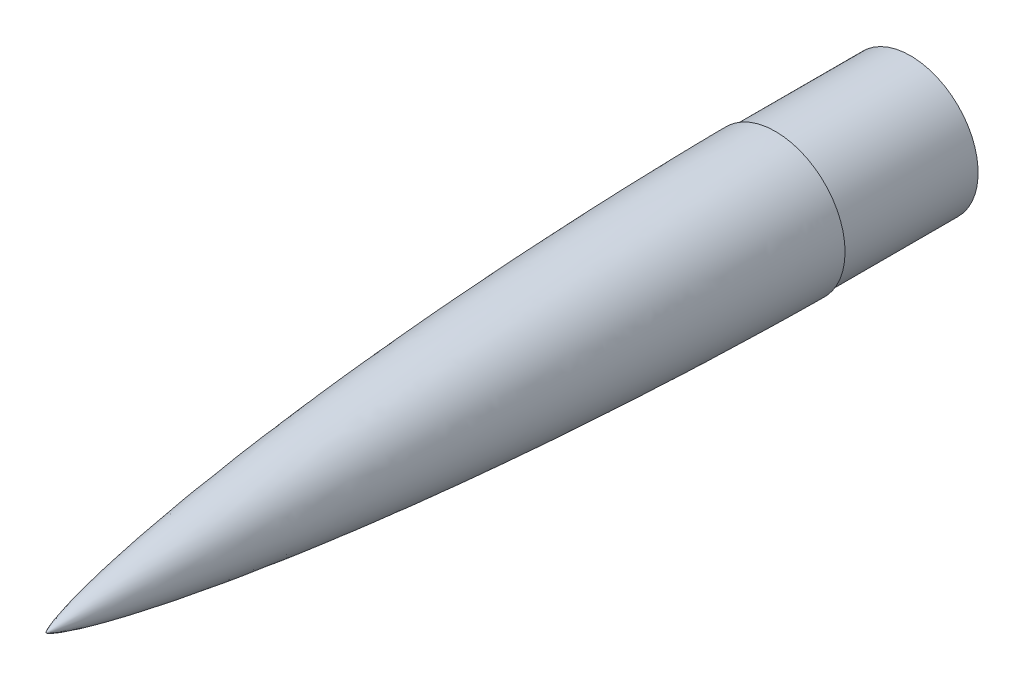
ISO-10303-21;
HEADER;
FILE_DESCRIPTION(('STEP AP214'),'2;1');
FILE_NAME('part.step','',(''),(''),'','','');
FILE_SCHEMA(('AUTOMOTIVE_DESIGN { 1 0 10303 214 1 1 1 1 }'));
ENDSEC;
DATA;
#1=APPLICATION_CONTEXT('core data for automotive mechanical design processes');
#2=APPLICATION_PROTOCOL_DEFINITION('international standard','automotive_design',2000,#1);
#3=PRODUCT_CONTEXT('',#1,'mechanical');
#4=PRODUCT('Part','Part','',(#3));
#5=PRODUCT_RELATED_PRODUCT_CATEGORY('part','',(#4));
#6=PRODUCT_DEFINITION_FORMATION('','',#4);
#7=PRODUCT_DEFINITION_CONTEXT('part definition',#1,'design');
#8=PRODUCT_DEFINITION('design','',#6,#7);
#9=PRODUCT_DEFINITION_SHAPE('','',#8);
#10=(LENGTH_UNIT() NAMED_UNIT(*) SI_UNIT(.MILLI.,.METRE.));
#11=(NAMED_UNIT(*) PLANE_ANGLE_UNIT() SI_UNIT($,.RADIAN.));
#12=(NAMED_UNIT(*) SI_UNIT($,.STERADIAN.) SOLID_ANGLE_UNIT());
#13=UNCERTAINTY_MEASURE_WITH_UNIT(LENGTH_MEASURE(1.E-05),#10,'distance_accuracy_value','');
#14=(GEOMETRIC_REPRESENTATION_CONTEXT(3) GLOBAL_UNCERTAINTY_ASSIGNED_CONTEXT((#13)) GLOBAL_UNIT_ASSIGNED_CONTEXT((#10,
#11,#12)) REPRESENTATION_CONTEXT('',''));
#15=CARTESIAN_POINT('',(0.,0.,0.));
#16=DIRECTION('',(0.,0.,1.));
#17=DIRECTION('',(1.,0.,0.));
#18=AXIS2_PLACEMENT_3D('',#15,#16,#17);
#19=CARTESIAN_POINT('',(0.,65.405,-685.8));
#20=CARTESIAN_POINT('',(0.,65.405,-684.485121272052));
#21=CARTESIAN_POINT('',(0.,65.3935205793124,-681.855376015666));
#22=CARTESIAN_POINT('',(0.,65.3735303170833,-677.910796563461));
#23=CARTESIAN_POINT('',(0.,65.3316998729456,-672.651436745629));
#24=CARTESIAN_POINT('',(0.,65.2692221043456,-666.077341219304));
#25=CARTESIAN_POINT('',(0.,65.1767470561121,-658.188600750671));
#26=CARTESIAN_POINT('',(0.,65.0474827604112,-648.94209479533));
#27=CARTESIAN_POINT('',(0.,64.7840244466443,-632.992707932571));
#28=CARTESIAN_POINT('',(0.,64.402473986804,-614.328747749962));
#29=CARTESIAN_POINT('',(0.,63.8726305660593,-592.951178627487));
#30=CARTESIAN_POINT('',(0.,63.0009991094314,-563.561033109567));
#31=CARTESIAN_POINT('',(0.,62.0623088945785,-536.847380859153));
#32=CARTESIAN_POINT('',(0.,60.9782163749543,-510.139226829273));
#33=CARTESIAN_POINT('',(0.,59.5005574289602,-478.097232785945));
#34=CARTESIAN_POINT('',(0.,57.8440341458656,-446.063808120787));
#35=CARTESIAN_POINT('',(0.,55.6441802473817,-408.706059524546));
#36=CARTESIAN_POINT('',(0.,52.7471290580236,-366.035691483811));
#37=CARTESIAN_POINT('',(0.,49.4446728295142,-323.394730687329));
#38=CARTESIAN_POINT('',(0.,45.7076004696462,-280.789499898449));
#39=CARTESIAN_POINT('',(0.,41.4956600630884,-238.228469901065));
#40=CARTESIAN_POINT('',(0.,36.754430002566,-195.722819830797));
#41=CARTESIAN_POINT('',(0.,31.4017407102855,-153.289449921695));
#42=CARTESIAN_POINT('',(0.,25.4687603314321,-112.040265782445));
#43=CARTESIAN_POINT('',(0.,19.5038981612316,-76.2047078542628));
#44=CARTESIAN_POINT('',(0.,13.9525085959273,-47.6298391838727));
#45=CARTESIAN_POINT('',(0.,9.38962699765855,-27.7350056304969));
#46=CARTESIAN_POINT('',(0.,6.31662131154601,-16.2109428625035));
#47=CARTESIAN_POINT('',(0.,4.18194651098269,-9.31832052248213));
#48=CARTESIAN_POINT('',(0.,2.79784507385194,-5.4483382524516));
#49=CARTESIAN_POINT('',(0.,1.91750850209447,-3.29300440985363));
#50=CARTESIAN_POINT('',(0.,1.37696095382615,-2.12335210684411));
#51=CARTESIAN_POINT('',(0.,1.04703872782662,-1.4784356818174));
#52=CARTESIAN_POINT('',(0.,0.822025620675648,-1.07155708893394));
#53=CARTESIAN_POINT('',(0.,0.67770029633276,-0.827068410392984));
#54=CARTESIAN_POINT('',(0.,0.546173066213784,-0.619898716914429));
#55=CARTESIAN_POINT('',(0.,0.428627231545043,-0.44979484773894));
#56=CARTESIAN_POINT('',(0.,0.349869153991174,-0.342466914738959));
#57=CARTESIAN_POINT('',(0.,0.276487255814619,-0.249756901936484));
#58=CARTESIAN_POINT('',(0.,0.208876089667496,-0.171483687558604));
#59=CARTESIAN_POINT('',(0.,0.147595052902646,-0.107673788922353));
#60=CARTESIAN_POINT('',(0.,0.10038741614022,-0.0636410587873789));
#61=CARTESIAN_POINT('',(0.,0.057075747949246,-0.0295232944577308));
#62=CARTESIAN_POINT('',(0.,0.0259041000770289,-0.00934966268541325));
#63=CARTESIAN_POINT('',(0.,0.00888026648789547,-0.00253064911690683));
#64=CARTESIAN_POINT('',(0.,0.,0.));
#65=B_SPLINE_CURVE_WITH_KNOTS('',4,(#19,#20,#21,#22,#23,#24,#25,#26,#27,#28,#29,#30,#31,#32,#33,
#34,#35,#36,#37,#38,#39,#40,#41,#42,#43,#44,#45,#46,#47,#48,#49,#50,#51,#52,#53,#54,#55,#56,#57,
#58,#59,#60,#61,#62,#63,#64),.UNSPECIFIED.,.F.,.F.,(5,1,1,1,1,1,1,1,1,1,1,1,1,1,1,1,1,1,1,1,1,1,
1,1,1,1,1,1,1,1,1,1,1,1,1,1,1,1,1,1,1,1,5),(0.,0.0076133259681177,0.0152266519362353,
0.0228399779043529,0.0304533038724706,0.0456799558087058,0.0609066077449411,0.076383683622995,
0.122814911257156,0.153768987695562,0.184723064133968,0.246630947086405,0.277585037404755,
0.308539127723105,0.370447211764446,0.432355342958083,0.494263450690412,0.556171550507095,
0.618079641608188,0.679987764671959,0.741895958561139,0.803803741959616,0.865712233170095,
0.921268011395524,0.952222444156783,0.972320807088128,0.983875785687456,0.990309813622096,
0.993990407520034,0.996111260196595,0.997352115754301,0.997768050198311,0.99818398464232,
0.998803112901376,0.998995768891883,0.999188424882391,0.999381080872898,0.999573736863405,
0.999680302647554,0.999786868431703,0.999893434215851,0.999946717107926,1.),.UNSPECIFIED.);
#66=CARTESIAN_POINT('',(0.,0.,0.));
#67=DIRECTION('',(0.,0.,1.));
#68=AXIS1_PLACEMENT('',#66,#67);
#69=SURFACE_OF_REVOLUTION('',#65,#68);
#70=CARTESIAN_POINT('',(0.,0.,0.));
#71=VERTEX_POINT('',#70);
#72=VERTEX_LOOP('',#71);
#73=FACE_BOUND('',#72,.T.);
#74=CARTESIAN_POINT('',(0.,0.,-685.8));
#75=DIRECTION('',(0.,0.,1.));
#76=DIRECTION('',(1.,0.,0.));
#77=AXIS2_PLACEMENT_3D('',#74,#75,#76);
#78=CIRCLE('',#77,65.405);
#79=CARTESIAN_POINT('',(65.405,0.,-685.8));
#80=VERTEX_POINT('',#79);
#81=EDGE_CURVE('E51',#80,#80,#78,.T.);
#82=ORIENTED_EDGE('',*,*,#81,.T.);
#83=EDGE_LOOP('',(#82));
#84=FACE_BOUND('',#83,.T.);
#85=ADVANCED_FACE('F43',(#73,#84),#69,.T.);
#86=CARTESIAN_POINT('',(0.,0.,-685.8));
#87=DIRECTION('',(0.,0.,1.));
#88=DIRECTION('',(1.,0.,0.));
#89=AXIS2_PLACEMENT_3D('',#86,#87,#88);
#90=PLANE('',#89);
#91=CARTESIAN_POINT('',(0.,0.,-685.8));
#92=DIRECTION('',(0.,0.,-1.));
#93=DIRECTION('',(-1.,0.,0.));
#94=AXIS2_PLACEMENT_3D('',#91,#92,#93);
#95=CIRCLE('',#94,63.5);
#96=CARTESIAN_POINT('',(-63.5,0.,-685.8));
#97=VERTEX_POINT('',#96);
#98=EDGE_CURVE('E84',#97,#97,#95,.T.);
#99=ORIENTED_EDGE('',*,*,#98,.F.);
#100=EDGE_LOOP('',(#99));
#101=FACE_BOUND('',#100,.T.);
#102=ORIENTED_EDGE('',*,*,#81,.F.);
#103=EDGE_LOOP('',(#102));
#104=FACE_BOUND('',#103,.T.);
#105=ADVANCED_FACE('F72',(#101,#104),#90,.F.);
#106=CARTESIAN_POINT('',(0.,0.,-812.8));
#107=DIRECTION('',(0.,0.,-1.));
#108=DIRECTION('',(-1.,0.,0.));
#109=AXIS2_PLACEMENT_3D('',#106,#107,#108);
#110=PLANE('',#109);
#111=CARTESIAN_POINT('',(0.,0.,-812.8));
#112=DIRECTION('',(0.,0.,-1.));
#113=DIRECTION('',(-1.,0.,0.));
#114=AXIS2_PLACEMENT_3D('',#111,#112,#113);
#115=CIRCLE('',#114,63.5);
#116=CARTESIAN_POINT('',(-63.5,0.,-812.8));
#117=VERTEX_POINT('',#116);
#118=EDGE_CURVE('E82',#117,#117,#115,.T.);
#119=ORIENTED_EDGE('',*,*,#118,.T.);
#120=EDGE_LOOP('',(#119));
#121=FACE_BOUND('',#120,.T.);
#122=CARTESIAN_POINT('',(0.,0.,-812.8));
#123=DIRECTION('',(0.,0.,-1.));
#124=DIRECTION('',(-1.,0.,0.));
#125=AXIS2_PLACEMENT_3D('',#122,#123,#124);
#126=CIRCLE('',#125,61.976);
#127=CARTESIAN_POINT('',(-61.976,0.,-812.8));
#128=VERTEX_POINT('',#127);
#129=EDGE_CURVE('E102',#128,#128,#126,.T.);
#130=ORIENTED_EDGE('',*,*,#129,.F.);
#131=EDGE_LOOP('',(#130));
#132=FACE_BOUND('',#131,.T.);
#133=ADVANCED_FACE('F76',(#121,#132),#110,.T.);
#134=CARTESIAN_POINT('',(0.,0.,-812.8));
#135=DIRECTION('',(0.,0.,1.));
#136=DIRECTION('',(1.,0.,0.));
#137=AXIS2_PLACEMENT_3D('',#134,#135,#136);
#138=CYLINDRICAL_SURFACE('',#137,63.5);
#139=ORIENTED_EDGE('',*,*,#118,.F.);
#140=EDGE_LOOP('',(#139));
#141=FACE_BOUND('',#140,.T.);
#142=ORIENTED_EDGE('',*,*,#98,.T.);
#143=EDGE_LOOP('',(#142));
#144=FACE_BOUND('',#143,.T.);
#145=ADVANCED_FACE('F65',(#141,#144),#138,.T.);
#146=CARTESIAN_POINT('',(0.,0.,-812.8));
#147=DIRECTION('',(0.,0.,1.));
#148=DIRECTION('',(1.,0.,0.));
#149=AXIS2_PLACEMENT_3D('',#146,#147,#148);
#150=CYLINDRICAL_SURFACE('',#149,61.976);
#151=ORIENTED_EDGE('',*,*,#129,.T.);
#152=EDGE_LOOP('',(#151));
#153=FACE_BOUND('',#152,.T.);
#154=CARTESIAN_POINT('',(0.,0.,-594.212276674996));
#155=DIRECTION('',(0.,0.,1.));
#156=DIRECTION('',(1.,0.,0.));
#157=AXIS2_PLACEMENT_3D('',#154,#155,#156);
#158=CIRCLE('',#157,61.976);
#159=CARTESIAN_POINT('',(61.976,0.,-594.212276674996));
#160=VERTEX_POINT('',#159);
#161=EDGE_CURVE('E11',#160,#160,#158,.T.);
#162=ORIENTED_EDGE('',*,*,#161,.T.);
#163=EDGE_LOOP('',(#162));
#164=FACE_BOUND('',#163,.T.);
#165=ADVANCED_FACE('F59',(#153,#164),#150,.F.);
#166=CARTESIAN_POINT('',(0.,65.405,-685.8));
#167=CARTESIAN_POINT('',(0.,65.405,-684.485121272052));
#168=CARTESIAN_POINT('',(0.,65.3935205793124,-681.855376015666));
#169=CARTESIAN_POINT('',(0.,65.3735303170833,-677.910796563461));
#170=CARTESIAN_POINT('',(0.,65.3316998729456,-672.651436745629));
#171=CARTESIAN_POINT('',(0.,65.2692221043456,-666.077341219304));
#172=CARTESIAN_POINT('',(0.,65.1767470561121,-658.188600750671));
#173=CARTESIAN_POINT('',(0.,65.0474827604112,-648.94209479533));
#174=CARTESIAN_POINT('',(0.,64.7840244466443,-632.992707932571));
#175=CARTESIAN_POINT('',(0.,64.402473986804,-614.328747749962));
#176=CARTESIAN_POINT('',(0.,63.8726305660593,-592.951178627487));
#177=CARTESIAN_POINT('',(0.,63.0009991094314,-563.561033109567));
#178=CARTESIAN_POINT('',(0.,62.0623088945785,-536.847380859153));
#179=CARTESIAN_POINT('',(0.,60.9782163749543,-510.139226829273));
#180=CARTESIAN_POINT('',(0.,59.5005574289602,-478.097232785945));
#181=CARTESIAN_POINT('',(0.,57.8440341458656,-446.063808120787));
#182=CARTESIAN_POINT('',(0.,55.6441802473817,-408.706059524546));
#183=CARTESIAN_POINT('',(0.,52.7471290580236,-366.035691483811));
#184=CARTESIAN_POINT('',(0.,49.4446728295142,-323.394730687329));
#185=CARTESIAN_POINT('',(0.,45.7076004696462,-280.789499898449));
#186=CARTESIAN_POINT('',(0.,41.4956600630884,-238.228469901065));
#187=CARTESIAN_POINT('',(0.,36.754430002566,-195.722819830797));
#188=CARTESIAN_POINT('',(0.,31.4017407102855,-153.289449921695));
#189=CARTESIAN_POINT('',(0.,25.4687603314321,-112.040265782445));
#190=CARTESIAN_POINT('',(0.,19.5038981612316,-76.2047078542628));
#191=CARTESIAN_POINT('',(0.,13.9525085959273,-47.6298391838727));
#192=CARTESIAN_POINT('',(0.,9.38962699765855,-27.7350056304969));
#193=CARTESIAN_POINT('',(0.,6.31662131154601,-16.2109428625035));
#194=CARTESIAN_POINT('',(0.,4.18194651098269,-9.31832052248213));
#195=CARTESIAN_POINT('',(0.,2.86085936024241,-5.62452777479995));
#196=CARTESIAN_POINT('',(0.,2.13938979815668,-3.83817748612035));
#197=CARTESIAN_POINT('',(0.,1.8133353557616,-3.09132914787673));
#198=CARTESIAN_POINT('',(0.,1.74047269633291,-2.92758102952471));
#199=B_SPLINE_CURVE_WITH_KNOTS('',4,(#166,#167,#168,#169,#170,#171,#172,#173,#174,#175,#176,
#177,#178,#179,#180,#181,#182,#183,#184,#185,#186,#187,#188,#189,#190,#191,#192,#193,#194,#195,
#196,#197,#198),.UNSPECIFIED.,.F.,.F.,(5,1,1,1,1,1,1,1,1,1,1,1,1,1,1,1,1,1,1,1,1,1,1,1,1,1,1,1,
1,5),(0.,0.0076133259681177,0.0152266519362353,0.0228399779043529,0.0304533038724706,
0.0456799558087058,0.0609066077449411,0.076383683622995,0.122814911257156,0.153768987695562,
0.184723064133968,0.246630947086405,0.277585037404755,0.308539127723105,0.370447211764446,
0.432355342958083,0.494263450690412,0.556171550507095,0.618079641608188,0.679987764671959,
0.741895958561139,0.803803741959616,0.865712233170095,0.921268011395524,0.952222444156783,
0.972320807088128,0.983875785687456,0.990309813622096,0.993990407520034,0.995028147076906),.UNSPECIFIED.);
#200=CARTESIAN_POINT('',(0.,0.,0.));
#201=DIRECTION('',(0.,0.,1.));
#202=AXIS1_PLACEMENT('',#200,#201);
#203=SURFACE_OF_REVOLUTION('',#199,#202);
#204=OFFSET_SURFACE('',#203,-1.90499999999998,.F.);
#205=ORIENTED_EDGE('',*,*,#161,.F.);
#206=EDGE_LOOP('',(#205));
#207=FACE_BOUND('',#206,.T.);
#208=CARTESIAN_POINT('',(0.,0.,-3.70203554292076));
#209=VERTEX_POINT('',#208);
#210=VERTEX_LOOP('',#209);
#211=FACE_BOUND('',#210,.T.);
#212=ADVANCED_FACE('F57',(#207,#211),#204,.F.);
#213=CLOSED_SHELL('',(#85,#105,#133,#145,#165,#212));
#214=MANIFOLD_SOLID_BREP('B2',#213);
#215=ADVANCED_BREP_SHAPE_REPRESENTATION('',(#18,#214),#14);
#216=SHAPE_DEFINITION_REPRESENTATION(#9,#215);
ENDSEC;
END-ISO-10303-21;
